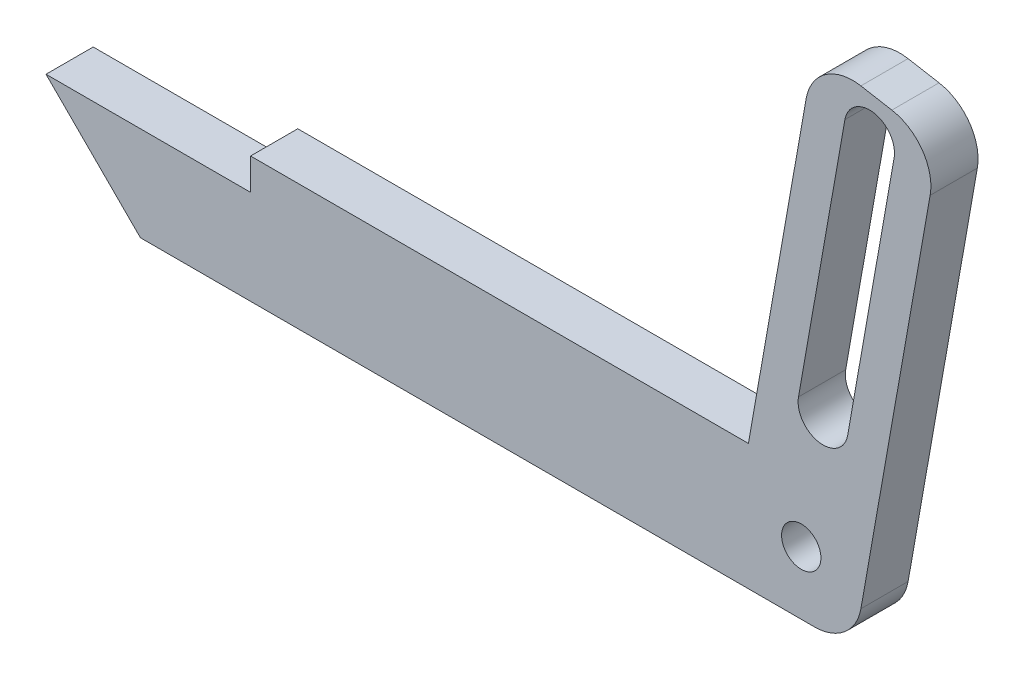
ISO-10303-21;
HEADER;
FILE_DESCRIPTION(('STEP AP214'),'2;1');
FILE_NAME('part.step','',(''),(''),'','','');
FILE_SCHEMA(('AUTOMOTIVE_DESIGN { 1 0 10303 214 1 1 1 1 }'));
ENDSEC;
DATA;
#1=APPLICATION_CONTEXT('core data for automotive mechanical design processes');
#2=APPLICATION_PROTOCOL_DEFINITION('international standard','automotive_design',2000,#1);
#3=PRODUCT_CONTEXT('',#1,'mechanical');
#4=PRODUCT('Part','Part','',(#3));
#5=PRODUCT_RELATED_PRODUCT_CATEGORY('part','',(#4));
#6=PRODUCT_DEFINITION_FORMATION('','',#4);
#7=PRODUCT_DEFINITION_CONTEXT('part definition',#1,'design');
#8=PRODUCT_DEFINITION('design','',#6,#7);
#9=PRODUCT_DEFINITION_SHAPE('','',#8);
#10=(LENGTH_UNIT() NAMED_UNIT(*) SI_UNIT(.MILLI.,.METRE.));
#11=(NAMED_UNIT(*) PLANE_ANGLE_UNIT() SI_UNIT($,.RADIAN.));
#12=(NAMED_UNIT(*) SI_UNIT($,.STERADIAN.) SOLID_ANGLE_UNIT());
#13=UNCERTAINTY_MEASURE_WITH_UNIT(LENGTH_MEASURE(1.E-05),#10,'distance_accuracy_value','');
#14=(GEOMETRIC_REPRESENTATION_CONTEXT(3) GLOBAL_UNCERTAINTY_ASSIGNED_CONTEXT((#13)) GLOBAL_UNIT_ASSIGNED_CONTEXT((#10,
#11,#12)) REPRESENTATION_CONTEXT('',''));
#15=CARTESIAN_POINT('',(0.,0.,0.));
#16=DIRECTION('',(0.,0.,1.));
#17=DIRECTION('',(1.,0.,0.));
#18=AXIS2_PLACEMENT_3D('',#15,#16,#17);
#19=CARTESIAN_POINT('',(-56.0247504159734,-23.4823211314476,3.));
#20=DIRECTION('',(0.707106781186545,0.70710678118655,0.));
#21=DIRECTION('',(-0.70710678118655,0.707106781186545,0.));
#22=AXIS2_PLACEMENT_3D('',#19,#20,#21);
#23=PLANE('',#22);
#24=DIRECTION('',(0.70710678118655,-0.707106781186545,0.));
#25=VECTOR('',#24,1.);
#26=CARTESIAN_POINT('',(-56.0247504159734,-23.4823211314476,3.));
#27=LINE('',#26,#25);
#28=CARTESIAN_POINT('',(-54.0247504159733,-25.4823211314476,3.));
#29=VERTEX_POINT('',#28);
#30=CARTESIAN_POINT('',(-48.0247504159733,-31.4823211314476,3.));
#31=VERTEX_POINT('',#30);
#32=EDGE_CURVE('E209',#29,#31,#27,.T.);
#33=ORIENTED_EDGE('',*,*,#32,.F.);
#34=DIRECTION('',(0.,0.,1.));
#35=VECTOR('',#34,1.);
#36=CARTESIAN_POINT('',(-54.0247504159733,-25.4823211314476,0.));
#37=LINE('',#36,#35);
#38=CARTESIAN_POINT('',(-54.0247504159733,-25.4823211314476,0.));
#39=VERTEX_POINT('',#38);
#40=EDGE_CURVE('E198',#39,#29,#37,.T.);
#41=ORIENTED_EDGE('',*,*,#40,.F.);
#42=DIRECTION('',(0.70710678118655,-0.707106781186545,0.));
#43=VECTOR('',#42,1.);
#44=CARTESIAN_POINT('',(-56.0247504159734,-23.4823211314476,0.));
#45=LINE('',#44,#43);
#46=CARTESIAN_POINT('',(-48.0247504159733,-31.4823211314476,0.));
#47=VERTEX_POINT('',#46);
#48=EDGE_CURVE('E205',#39,#47,#45,.T.);
#49=ORIENTED_EDGE('',*,*,#48,.T.);
#50=DIRECTION('',(0.,0.,-1.));
#51=VECTOR('',#50,1.);
#52=CARTESIAN_POINT('',(-48.0247504159733,-31.4823211314476,3.));
#53=LINE('',#52,#51);
#54=EDGE_CURVE('E241',#31,#47,#53,.T.);
#55=ORIENTED_EDGE('',*,*,#54,.F.);
#56=EDGE_LOOP('',(#33,#41,#49,#55));
#57=FACE_BOUND('',#56,.T.);
#58=ADVANCED_FACE('F36',(#57),#23,.F.);
#59=CARTESIAN_POINT('',(-2.67195336655509,-31.4823211314476,3.));
#60=DIRECTION('',(0.,1.,0.));
#61=DIRECTION('',(-1.,0.,0.));
#62=AXIS2_PLACEMENT_3D('',#59,#60,#61);
#63=PLANE('',#62);
#64=DIRECTION('',(1.,0.,0.));
#65=VECTOR('',#64,1.);
#66=CARTESIAN_POINT('',(-2.67195336655509,-31.4823211314476,0.));
#67=LINE('',#66,#65);
#68=CARTESIAN_POINT('',(-5.18925226008694,-31.4823211314476,0.));
#69=VERTEX_POINT('',#68);
#70=EDGE_CURVE('E227',#47,#69,#67,.T.);
#71=ORIENTED_EDGE('',*,*,#70,.T.);
#72=DIRECTION('',(0.,0.,-1.));
#73=VECTOR('',#72,1.);
#74=CARTESIAN_POINT('',(-5.18925226008694,-31.4823211314476,3.));
#75=LINE('',#74,#73);
#76=CARTESIAN_POINT('',(-5.18925226008694,-31.4823211314476,3.));
#77=VERTEX_POINT('',#76);
#78=EDGE_CURVE('E255',#69,#77,#75,.F.);
#79=ORIENTED_EDGE('',*,*,#78,.T.);
#80=DIRECTION('',(1.,0.,0.));
#81=VECTOR('',#80,1.);
#82=CARTESIAN_POINT('',(-2.67195336655509,-31.4823211314476,3.));
#83=LINE('',#82,#81);
#84=EDGE_CURVE('E211',#31,#77,#83,.T.);
#85=ORIENTED_EDGE('',*,*,#84,.F.);
#86=ORIENTED_EDGE('',*,*,#54,.T.);
#87=EDGE_LOOP('',(#71,#79,#85,#86));
#88=FACE_BOUND('',#87,.T.);
#89=ADVANCED_FACE('F299',(#88),#63,.F.);
#90=CARTESIAN_POINT('',(2.68557861700396,-1.09824739506822,3.));
#91=DIRECTION('',(-0.984807753012209,0.173648177666927,0.));
#92=DIRECTION('',(-0.173648177666927,-0.984807753012209,0.));
#93=AXIS2_PLACEMENT_3D('',#90,#91,#92);
#94=PLANE('',#93);
#95=DIRECTION('',(0.173648177666927,0.984807753012208,0.));
#96=VECTOR('',#95,1.);
#97=CARTESIAN_POINT('',(2.68557861700396,-1.09824739506822,3.));
#98=LINE('',#97,#96);
#99=CARTESIAN_POINT('',(-2.23482900105031,-29.0032656644484,3.));
#100=VERTEX_POINT('',#99);
#101=CARTESIAN_POINT('',(2.16463408400317,-4.05267065410488,3.));
#102=VERTEX_POINT('',#101);
#103=EDGE_CURVE('E215',#100,#102,#98,.T.);
#104=ORIENTED_EDGE('',*,*,#103,.F.);
#105=DIRECTION('',(0.,0.,-1.));
#106=VECTOR('',#105,1.);
#107=CARTESIAN_POINT('',(-2.23482900105031,-29.0032656644484,3.));
#108=LINE('',#107,#106);
#109=CARTESIAN_POINT('',(-2.23482900105031,-29.0032656644484,0.));
#110=VERTEX_POINT('',#109);
#111=EDGE_CURVE('E246',#100,#110,#108,.T.);
#112=ORIENTED_EDGE('',*,*,#111,.T.);
#113=DIRECTION('',(0.173648177666927,0.984807753012208,0.));
#114=VECTOR('',#113,1.);
#115=CARTESIAN_POINT('',(2.68557861700396,-1.09824739506822,0.));
#116=LINE('',#115,#114);
#117=CARTESIAN_POINT('',(2.16463408400317,-4.05267065410488,0.));
#118=VERTEX_POINT('',#117);
#119=EDGE_CURVE('E230',#110,#118,#116,.T.);
#120=ORIENTED_EDGE('',*,*,#119,.T.);
#121=DIRECTION('',(0.,0.,-1.));
#122=VECTOR('',#121,1.);
#123=CARTESIAN_POINT('',(2.16463408400317,-4.05267065410488,3.));
#124=LINE('',#123,#122);
#125=EDGE_CURVE('E244',#118,#102,#124,.F.);
#126=ORIENTED_EDGE('',*,*,#125,.T.);
#127=EDGE_LOOP('',(#104,#112,#120,#126));
#128=FACE_BOUND('',#127,.T.);
#129=ADVANCED_FACE('F306',(#128),#94,.F.);
#130=CARTESIAN_POINT('',(-5.19288340709372,0.290938026267115,3.));
#131=DIRECTION('',(-0.173648177666917,-0.98480775301221,0.));
#132=DIRECTION('',(0.98480775301221,-0.173648177666917,0.));
#133=AXIS2_PLACEMENT_3D('',#130,#131,#132);
#134=PLANE('',#133);
#135=DIRECTION('',(-0.98480775301221,0.173648177666917,0.));
#136=VECTOR('',#135,1.);
#137=CARTESIAN_POINT('',(-5.19288340709372,0.290938026267115,0.));
#138=LINE('',#137,#136);
#139=CARTESIAN_POINT('',(-0.2688446420327,-0.577302862067467,0.));
#140=VERTEX_POINT('',#139);
#141=CARTESIAN_POINT('',(-2.23846014805712,-0.230006506733632,0.));
#142=VERTEX_POINT('',#141);
#143=EDGE_CURVE('E233',#140,#142,#138,.T.);
#144=ORIENTED_EDGE('',*,*,#143,.T.);
#145=DIRECTION('',(0.,0.,-1.));
#146=VECTOR('',#145,1.);
#147=CARTESIAN_POINT('',(-2.23846014805712,-0.230006506733632,3.));
#148=LINE('',#147,#146);
#149=CARTESIAN_POINT('',(-2.23846014805712,-0.230006506733632,3.));
#150=VERTEX_POINT('',#149);
#151=EDGE_CURVE('E11',#142,#150,#148,.F.);
#152=ORIENTED_EDGE('',*,*,#151,.T.);
#153=DIRECTION('',(-0.98480775301221,0.173648177666917,0.));
#154=VECTOR('',#153,1.);
#155=CARTESIAN_POINT('',(-5.19288340709372,0.290938026267115,3.));
#156=LINE('',#155,#154);
#157=CARTESIAN_POINT('',(-0.2688446420327,-0.577302862067467,3.));
#158=VERTEX_POINT('',#157);
#159=EDGE_CURVE('E218',#158,#150,#156,.T.);
#160=ORIENTED_EDGE('',*,*,#159,.F.);
#161=DIRECTION('',(0.,0.,-1.));
#162=VECTOR('',#161,1.);
#163=CARTESIAN_POINT('',(-0.268844642032699,-0.577302862067467,3.));
#164=LINE('',#163,#162);
#165=EDGE_CURVE('E44',#158,#140,#164,.T.);
#166=ORIENTED_EDGE('',*,*,#165,.T.);
#167=EDGE_LOOP('',(#144,#152,#160,#166));
#168=FACE_BOUND('',#167,.T.);
#169=ADVANCED_FACE('F267',(#168),#134,.F.);
#170=CARTESIAN_POINT('',(-9.38475041597335,-23.4823211314476,3.));
#171=DIRECTION('',(0.984807753012209,-0.173648177666927,0.));
#172=DIRECTION('',(0.173648177666927,0.984807753012209,0.));
#173=AXIS2_PLACEMENT_3D('',#170,#171,#172);
#174=PLANE('',#173);
#175=DIRECTION('',(-0.173648177666927,-0.984807753012209,0.));
#176=VECTOR('',#175,1.);
#177=CARTESIAN_POINT('',(-9.38475041597335,-23.4823211314476,3.));
#178=LINE('',#177,#176);
#179=CARTESIAN_POINT('',(-5.7138279400945,-2.66348523276948,3.));
#180=VERTEX_POINT('',#179);
#181=CARTESIAN_POINT('',(-9.38475041597335,-23.4823211314476,3.));
#182=VERTEX_POINT('',#181);
#183=EDGE_CURVE('E220',#180,#182,#178,.T.);
#184=ORIENTED_EDGE('',*,*,#183,.F.);
#185=DIRECTION('',(0.,0.,-1.));
#186=VECTOR('',#185,1.);
#187=CARTESIAN_POINT('',(-5.7138279400945,-2.66348523276948,3.));
#188=LINE('',#187,#186);
#189=CARTESIAN_POINT('',(-5.7138279400945,-2.66348523276948,0.));
#190=VERTEX_POINT('',#189);
#191=EDGE_CURVE('E262',#180,#190,#188,.T.);
#192=ORIENTED_EDGE('',*,*,#191,.T.);
#193=DIRECTION('',(-0.173648177666927,-0.984807753012209,0.));
#194=VECTOR('',#193,1.);
#195=CARTESIAN_POINT('',(-9.38475041597335,-23.4823211314476,0.));
#196=LINE('',#195,#194);
#197=CARTESIAN_POINT('',(-9.38475041597335,-23.4823211314476,0.));
#198=VERTEX_POINT('',#197);
#199=EDGE_CURVE('E235',#190,#198,#196,.T.);
#200=ORIENTED_EDGE('',*,*,#199,.T.);
#201=DIRECTION('',(0.,0.,-1.));
#202=VECTOR('',#201,1.);
#203=CARTESIAN_POINT('',(-9.38475041597335,-23.4823211314476,3.));
#204=LINE('',#203,#202);
#205=EDGE_CURVE('E225',#182,#198,#204,.T.);
#206=ORIENTED_EDGE('',*,*,#205,.F.);
#207=EDGE_LOOP('',(#184,#192,#200,#206));
#208=FACE_BOUND('',#207,.T.);
#209=ADVANCED_FACE('F277',(#208),#174,.F.);
#210=CARTESIAN_POINT('',(-56.0247504159734,-23.4823211314476,3.));
#211=DIRECTION('',(0.,-1.,0.));
#212=DIRECTION('',(0.,0.,-1.));
#213=AXIS2_PLACEMENT_3D('',#210,#211,#212);
#214=PLANE('',#213);
#215=DIRECTION('',(-1.,0.,0.));
#216=VECTOR('',#215,1.);
#217=CARTESIAN_POINT('',(-56.0247504159734,-23.4823211314476,0.));
#218=LINE('',#217,#216);
#219=CARTESIAN_POINT('',(-41.0247504159734,-23.4823211314476,0.));
#220=VERTEX_POINT('',#219);
#221=EDGE_CURVE('E212',#198,#220,#218,.T.);
#222=ORIENTED_EDGE('',*,*,#221,.T.);
#223=DIRECTION('',(0.,0.,1.));
#224=VECTOR('',#223,1.);
#225=CARTESIAN_POINT('',(-41.0247504159734,-23.4823211314476,0.));
#226=LINE('',#225,#224);
#227=CARTESIAN_POINT('',(-41.0247504159734,-23.4823211314476,3.));
#228=VERTEX_POINT('',#227);
#229=EDGE_CURVE('E202',#220,#228,#226,.T.);
#230=ORIENTED_EDGE('',*,*,#229,.T.);
#231=DIRECTION('',(-1.,0.,0.));
#232=VECTOR('',#231,1.);
#233=CARTESIAN_POINT('',(-56.0247504159734,-23.4823211314476,3.));
#234=LINE('',#233,#232);
#235=EDGE_CURVE('E222',#182,#228,#234,.T.);
#236=ORIENTED_EDGE('',*,*,#235,.F.);
#237=ORIENTED_EDGE('',*,*,#205,.T.);
#238=EDGE_LOOP('',(#222,#230,#236,#237));
#239=FACE_BOUND('',#238,.T.);
#240=ADVANCED_FACE('F284',(#239),#214,.F.);
#241=CARTESIAN_POINT('',(0.,0.,3.));
#242=DIRECTION('',(0.,0.,-1.));
#243=DIRECTION('',(-1.,0.,0.));
#244=AXIS2_PLACEMENT_3D('',#241,#242,#243);
#245=PLANE('',#244);
#246=CARTESIAN_POINT('',(-6.02835189126393,-27.4823211314476,3.));
#247=DIRECTION('',(0.,0.,1.));
#248=DIRECTION('',(1.,0.,0.));
#249=AXIS2_PLACEMENT_3D('',#246,#247,#248);
#250=CIRCLE('',#249,1.25);
#251=CARTESIAN_POINT('',(-4.77835189126393,-27.4823211314476,3.));
#252=VERTEX_POINT('',#251);
#253=EDGE_CURVE('E174',#252,#252,#250,.T.);
#254=ORIENTED_EDGE('',*,*,#253,.F.);
#255=EDGE_LOOP('',(#254));
#256=FACE_BOUND('',#255,.T.);
#257=DIRECTION('',(-0.173648177666927,-0.984807753012209,0.));
#258=VECTOR('',#257,1.);
#259=CARTESIAN_POINT('',(-3.25115514711906,-2.59000758488485,3.));
#260=LINE('',#259,#258);
#261=CARTESIAN_POINT('',(-3.25115514711906,-2.59000758488485,3.));
#262=VERTEX_POINT('',#261);
#263=CARTESIAN_POINT('',(-6.20317416745682,-19.3317393860924,3.));
#264=VERTEX_POINT('',#263);
#265=EDGE_CURVE('E180',#262,#264,#260,.T.);
#266=ORIENTED_EDGE('',*,*,#265,.F.);
#267=CARTESIAN_POINT('',(-1.68777283921217,-2.86567406693108,3.));
#268=DIRECTION('',(0.,0.,1.));
#269=DIRECTION('',(1.,0.,0.));
#270=AXIS2_PLACEMENT_3D('',#267,#268,#269);
#271=CIRCLE('',#270,1.5875);
#272=CARTESIAN_POINT('',(-0.12439053130529,-3.14134054897731,3.));
#273=VERTEX_POINT('',#272);
#274=EDGE_CURVE('E150',#273,#262,#271,.T.);
#275=ORIENTED_EDGE('',*,*,#274,.F.);
#276=DIRECTION('',(0.173648177666927,0.984807753012209,0.));
#277=VECTOR('',#276,1.);
#278=CARTESIAN_POINT('',(-0.12439053130529,-3.14134054897731,3.));
#279=LINE('',#278,#277);
#280=CARTESIAN_POINT('',(-3.07640955164306,-19.8830723501849,3.));
#281=VERTEX_POINT('',#280);
#282=EDGE_CURVE('E168',#281,#273,#279,.T.);
#283=ORIENTED_EDGE('',*,*,#282,.F.);
#284=CARTESIAN_POINT('',(-4.63979185954994,-19.6074058681386,3.));
#285=DIRECTION('',(0.,0.,1.));
#286=DIRECTION('',(1.,0.,0.));
#287=AXIS2_PLACEMENT_3D('',#284,#285,#286);
#288=CIRCLE('',#287,1.5875);
#289=EDGE_CURVE('E171',#264,#281,#288,.T.);
#290=ORIENTED_EDGE('',*,*,#289,.F.);
#291=EDGE_LOOP('',(#266,#275,#283,#290));
#292=FACE_BOUND('',#291,.T.);
#293=ORIENTED_EDGE('',*,*,#84,.T.);
#294=CARTESIAN_POINT('',(-5.18925226008694,-28.4823211314476,3.));
#295=DIRECTION('',(0.,0.,-1.));
#296=DIRECTION('',(-1.,0.,0.));
#297=AXIS2_PLACEMENT_3D('',#294,#295,#296);
#298=CIRCLE('',#297,3.);
#299=EDGE_CURVE('E260',#77,#100,#298,.F.);
#300=ORIENTED_EDGE('',*,*,#299,.T.);
#301=ORIENTED_EDGE('',*,*,#103,.T.);
#302=CARTESIAN_POINT('',(-0.789789175033451,-3.5317261211041,3.));
#303=DIRECTION('',(0.,0.,-1.));
#304=DIRECTION('',(-1.,0.,0.));
#305=AXIS2_PLACEMENT_3D('',#302,#303,#304);
#306=CIRCLE('',#305,3.);
#307=EDGE_CURVE('E257',#102,#158,#306,.F.);
#308=ORIENTED_EDGE('',*,*,#307,.T.);
#309=ORIENTED_EDGE('',*,*,#159,.T.);
#310=CARTESIAN_POINT('',(-2.75940468105787,-3.18442976577026,3.));
#311=DIRECTION('',(0.,0.,-1.));
#312=DIRECTION('',(-1.,0.,0.));
#313=AXIS2_PLACEMENT_3D('',#310,#311,#312);
#314=CIRCLE('',#313,3.);
#315=EDGE_CURVE('E51',#150,#180,#314,.F.);
#316=ORIENTED_EDGE('',*,*,#315,.T.);
#317=ORIENTED_EDGE('',*,*,#183,.T.);
#318=ORIENTED_EDGE('',*,*,#235,.T.);
#319=DIRECTION('',(0.,1.,0.));
#320=VECTOR('',#319,1.);
#321=CARTESIAN_POINT('',(-41.0247504159734,-23.4823211314476,3.));
#322=LINE('',#321,#320);
#323=CARTESIAN_POINT('',(-41.0247504159733,-25.4823211314476,3.));
#324=VERTEX_POINT('',#323);
#325=EDGE_CURVE('E195',#324,#228,#322,.T.);
#326=ORIENTED_EDGE('',*,*,#325,.F.);
#327=DIRECTION('',(1.,0.,0.));
#328=VECTOR('',#327,1.);
#329=CARTESIAN_POINT('',(-41.0247504159733,-25.4823211314476,3.));
#330=LINE('',#329,#328);
#331=EDGE_CURVE('E187',#29,#324,#330,.T.);
#332=ORIENTED_EDGE('',*,*,#331,.F.);
#333=ORIENTED_EDGE('',*,*,#32,.T.);
#334=EDGE_LOOP('',(#293,#300,#301,#308,#309,#316,#317,#318,#326,#332,#333));
#335=FACE_BOUND('',#334,.T.);
#336=ADVANCED_FACE('F280',(#256,#292,#335),#245,.F.);
#337=CARTESIAN_POINT('',(0.,0.,0.));
#338=DIRECTION('',(0.,0.,-1.));
#339=DIRECTION('',(-1.,0.,0.));
#340=AXIS2_PLACEMENT_3D('',#337,#338,#339);
#341=PLANE('',#340);
#342=CARTESIAN_POINT('',(-6.02835189126393,-27.4823211314476,0.));
#343=DIRECTION('',(0.,0.,1.));
#344=DIRECTION('',(1.,0.,0.));
#345=AXIS2_PLACEMENT_3D('',#342,#343,#344);
#346=CIRCLE('',#345,1.25);
#347=CARTESIAN_POINT('',(-4.77835189126393,-27.4823211314476,0.));
#348=VERTEX_POINT('',#347);
#349=EDGE_CURVE('E181',#348,#348,#346,.T.);
#350=ORIENTED_EDGE('',*,*,#349,.T.);
#351=EDGE_LOOP('',(#350));
#352=FACE_BOUND('',#351,.T.);
#353=CARTESIAN_POINT('',(-1.68777283921217,-2.86567406693108,0.));
#354=DIRECTION('',(0.,0.,1.));
#355=DIRECTION('',(1.,0.,0.));
#356=AXIS2_PLACEMENT_3D('',#353,#354,#355);
#357=CIRCLE('',#356,1.5875);
#358=CARTESIAN_POINT('',(-0.12439053130529,-3.14134054897731,0.));
#359=VERTEX_POINT('',#358);
#360=CARTESIAN_POINT('',(-3.25115514711906,-2.59000758488485,0.));
#361=VERTEX_POINT('',#360);
#362=EDGE_CURVE('E147',#359,#361,#357,.T.);
#363=ORIENTED_EDGE('',*,*,#362,.T.);
#364=DIRECTION('',(-0.173648177666927,-0.984807753012209,0.));
#365=VECTOR('',#364,1.);
#366=CARTESIAN_POINT('',(-3.25115514711906,-2.59000758488485,0.));
#367=LINE('',#366,#365);
#368=CARTESIAN_POINT('',(-6.20317416745682,-19.3317393860924,0.));
#369=VERTEX_POINT('',#368);
#370=EDGE_CURVE('E159',#361,#369,#367,.T.);
#371=ORIENTED_EDGE('',*,*,#370,.T.);
#372=CARTESIAN_POINT('',(-4.63979185954994,-19.6074058681386,0.));
#373=DIRECTION('',(0.,0.,1.));
#374=DIRECTION('',(1.,0.,0.));
#375=AXIS2_PLACEMENT_3D('',#372,#373,#374);
#376=CIRCLE('',#375,1.5875);
#377=CARTESIAN_POINT('',(-3.07640955164306,-19.8830723501849,0.));
#378=VERTEX_POINT('',#377);
#379=EDGE_CURVE('E163',#369,#378,#376,.T.);
#380=ORIENTED_EDGE('',*,*,#379,.T.);
#381=DIRECTION('',(0.173648177666927,0.984807753012209,0.));
#382=VECTOR('',#381,1.);
#383=CARTESIAN_POINT('',(-0.12439053130529,-3.14134054897731,0.));
#384=LINE('',#383,#382);
#385=EDGE_CURVE('E155',#378,#359,#384,.T.);
#386=ORIENTED_EDGE('',*,*,#385,.T.);
#387=EDGE_LOOP('',(#363,#371,#380,#386));
#388=FACE_BOUND('',#387,.T.);
#389=ORIENTED_EDGE('',*,*,#119,.F.);
#390=CARTESIAN_POINT('',(-5.18925226008694,-28.4823211314476,0.));
#391=DIRECTION('',(0.,0.,-1.));
#392=DIRECTION('',(-1.,0.,0.));
#393=AXIS2_PLACEMENT_3D('',#390,#391,#392);
#394=CIRCLE('',#393,3.);
#395=EDGE_CURVE('E253',#110,#69,#394,.T.);
#396=ORIENTED_EDGE('',*,*,#395,.T.);
#397=ORIENTED_EDGE('',*,*,#70,.F.);
#398=ORIENTED_EDGE('',*,*,#48,.F.);
#399=DIRECTION('',(1.,0.,0.));
#400=VECTOR('',#399,1.);
#401=CARTESIAN_POINT('',(-41.0247504159733,-25.4823211314476,0.));
#402=LINE('',#401,#400);
#403=CARTESIAN_POINT('',(-41.0247504159733,-25.4823211314476,0.));
#404=VERTEX_POINT('',#403);
#405=EDGE_CURVE('E191',#39,#404,#402,.T.);
#406=ORIENTED_EDGE('',*,*,#405,.T.);
#407=DIRECTION('',(0.,1.,0.));
#408=VECTOR('',#407,1.);
#409=CARTESIAN_POINT('',(-41.0247504159734,-23.4823211314476,0.));
#410=LINE('',#409,#408);
#411=EDGE_CURVE('E194',#404,#220,#410,.T.);
#412=ORIENTED_EDGE('',*,*,#411,.T.);
#413=ORIENTED_EDGE('',*,*,#221,.F.);
#414=ORIENTED_EDGE('',*,*,#199,.F.);
#415=CARTESIAN_POINT('',(-2.75940468105787,-3.18442976577026,0.));
#416=DIRECTION('',(0.,0.,-1.));
#417=DIRECTION('',(-1.,0.,0.));
#418=AXIS2_PLACEMENT_3D('',#415,#416,#417);
#419=CIRCLE('',#418,3.);
#420=EDGE_CURVE('E251',#190,#142,#419,.T.);
#421=ORIENTED_EDGE('',*,*,#420,.T.);
#422=ORIENTED_EDGE('',*,*,#143,.F.);
#423=CARTESIAN_POINT('',(-0.789789175033451,-3.5317261211041,0.));
#424=DIRECTION('',(0.,0.,-1.));
#425=DIRECTION('',(-1.,0.,0.));
#426=AXIS2_PLACEMENT_3D('',#423,#424,#425);
#427=CIRCLE('',#426,3.);
#428=EDGE_CURVE('E249',#140,#118,#427,.T.);
#429=ORIENTED_EDGE('',*,*,#428,.T.);
#430=EDGE_LOOP('',(#389,#396,#397,#398,#406,#412,#413,#414,#421,#422,#429));
#431=FACE_BOUND('',#430,.T.);
#432=ADVANCED_FACE('F165',(#352,#388,#431),#341,.T.);
#433=CARTESIAN_POINT('',(-41.0247504159734,-23.4823211314476,0.));
#434=DIRECTION('',(1.,0.,0.));
#435=DIRECTION('',(0.,1.,0.));
#436=AXIS2_PLACEMENT_3D('',#433,#434,#435);
#437=PLANE('',#436);
#438=ORIENTED_EDGE('',*,*,#325,.T.);
#439=ORIENTED_EDGE('',*,*,#229,.F.);
#440=ORIENTED_EDGE('',*,*,#411,.F.);
#441=DIRECTION('',(0.,0.,1.));
#442=VECTOR('',#441,1.);
#443=CARTESIAN_POINT('',(-41.0247504159733,-25.4823211314476,0.));
#444=LINE('',#443,#442);
#445=EDGE_CURVE('E206',#404,#324,#444,.T.);
#446=ORIENTED_EDGE('',*,*,#445,.T.);
#447=EDGE_LOOP('',(#438,#439,#440,#446));
#448=FACE_BOUND('',#447,.T.);
#449=ADVANCED_FACE('F286',(#448),#437,.F.);
#450=CARTESIAN_POINT('',(-41.0247504159733,-25.4823211314476,0.));
#451=DIRECTION('',(0.,-1.,0.));
#452=DIRECTION('',(0.,0.,-1.));
#453=AXIS2_PLACEMENT_3D('',#450,#451,#452);
#454=PLANE('',#453);
#455=ORIENTED_EDGE('',*,*,#331,.T.);
#456=ORIENTED_EDGE('',*,*,#445,.F.);
#457=ORIENTED_EDGE('',*,*,#405,.F.);
#458=ORIENTED_EDGE('',*,*,#40,.T.);
#459=EDGE_LOOP('',(#455,#456,#457,#458));
#460=FACE_BOUND('',#459,.T.);
#461=ADVANCED_FACE('F292',(#460),#454,.F.);
#462=CARTESIAN_POINT('',(-1.68777283921217,-2.86567406693108,0.));
#463=DIRECTION('',(0.,0.,1.));
#464=DIRECTION('',(1.,0.,0.));
#465=AXIS2_PLACEMENT_3D('',#462,#463,#464);
#466=CYLINDRICAL_SURFACE('',#465,1.5875);
#467=ORIENTED_EDGE('',*,*,#274,.T.);
#468=DIRECTION('',(0.,0.,1.));
#469=VECTOR('',#468,1.);
#470=CARTESIAN_POINT('',(-3.25115514711906,-2.59000758488485,0.));
#471=LINE('',#470,#469);
#472=EDGE_CURVE('E143',#361,#262,#471,.T.);
#473=ORIENTED_EDGE('',*,*,#472,.F.);
#474=ORIENTED_EDGE('',*,*,#362,.F.);
#475=DIRECTION('',(0.,0.,1.));
#476=VECTOR('',#475,1.);
#477=CARTESIAN_POINT('',(-0.12439053130529,-3.14134054897731,0.));
#478=LINE('',#477,#476);
#479=EDGE_CURVE('E185',#359,#273,#478,.T.);
#480=ORIENTED_EDGE('',*,*,#479,.T.);
#481=EDGE_LOOP('',(#467,#473,#474,#480));
#482=FACE_BOUND('',#481,.T.);
#483=ADVANCED_FACE('F145',(#482),#466,.F.);
#484=CARTESIAN_POINT('',(-0.12439053130529,-3.14134054897731,0.));
#485=DIRECTION('',(0.984807753012209,-0.173648177666927,0.));
#486=DIRECTION('',(0.173648177666927,0.984807753012209,0.));
#487=AXIS2_PLACEMENT_3D('',#484,#485,#486);
#488=PLANE('',#487);
#489=ORIENTED_EDGE('',*,*,#282,.T.);
#490=ORIENTED_EDGE('',*,*,#479,.F.);
#491=ORIENTED_EDGE('',*,*,#385,.F.);
#492=DIRECTION('',(0.,0.,1.));
#493=VECTOR('',#492,1.);
#494=CARTESIAN_POINT('',(-3.07640955164306,-19.8830723501849,0.));
#495=LINE('',#494,#493);
#496=EDGE_CURVE('E188',#378,#281,#495,.T.);
#497=ORIENTED_EDGE('',*,*,#496,.T.);
#498=EDGE_LOOP('',(#489,#490,#491,#497));
#499=FACE_BOUND('',#498,.T.);
#500=ADVANCED_FACE('F335',(#499),#488,.F.);
#501=CARTESIAN_POINT('',(-4.63979185954994,-19.6074058681386,0.));
#502=DIRECTION('',(0.,0.,1.));
#503=DIRECTION('',(1.,0.,0.));
#504=AXIS2_PLACEMENT_3D('',#501,#502,#503);
#505=CYLINDRICAL_SURFACE('',#504,1.5875);
#506=ORIENTED_EDGE('',*,*,#289,.T.);
#507=ORIENTED_EDGE('',*,*,#496,.F.);
#508=ORIENTED_EDGE('',*,*,#379,.F.);
#509=DIRECTION('',(0.,0.,1.));
#510=VECTOR('',#509,1.);
#511=CARTESIAN_POINT('',(-6.20317416745682,-19.3317393860924,0.));
#512=LINE('',#511,#510);
#513=EDGE_CURVE('E154',#369,#264,#512,.T.);
#514=ORIENTED_EDGE('',*,*,#513,.T.);
#515=EDGE_LOOP('',(#506,#507,#508,#514));
#516=FACE_BOUND('',#515,.T.);
#517=ADVANCED_FACE('F330',(#516),#505,.F.);
#518=CARTESIAN_POINT('',(-3.25115514711906,-2.59000758488485,0.));
#519=DIRECTION('',(-0.984807753012209,0.173648177666927,0.));
#520=DIRECTION('',(-0.173648177666927,-0.984807753012209,0.));
#521=AXIS2_PLACEMENT_3D('',#518,#519,#520);
#522=PLANE('',#521);
#523=ORIENTED_EDGE('',*,*,#265,.T.);
#524=ORIENTED_EDGE('',*,*,#513,.F.);
#525=ORIENTED_EDGE('',*,*,#370,.F.);
#526=ORIENTED_EDGE('',*,*,#472,.T.);
#527=EDGE_LOOP('',(#523,#524,#525,#526));
#528=FACE_BOUND('',#527,.T.);
#529=ADVANCED_FACE('F160',(#528),#522,.F.);
#530=CARTESIAN_POINT('',(-6.02835189126393,-27.4823211314476,0.));
#531=DIRECTION('',(0.,0.,1.));
#532=DIRECTION('',(1.,0.,0.));
#533=AXIS2_PLACEMENT_3D('',#530,#531,#532);
#534=CYLINDRICAL_SURFACE('',#533,1.25);
#535=ORIENTED_EDGE('',*,*,#349,.F.);
#536=EDGE_LOOP('',(#535));
#537=FACE_BOUND('',#536,.T.);
#538=ORIENTED_EDGE('',*,*,#253,.T.);
#539=EDGE_LOOP('',(#538));
#540=FACE_BOUND('',#539,.T.);
#541=ADVANCED_FACE('F321',(#537,#540),#534,.F.);
#542=CARTESIAN_POINT('',(-5.18925226008694,-28.4823211314476,3.));
#543=DIRECTION('',(0.,0.,-1.));
#544=DIRECTION('',(-1.,0.,0.));
#545=AXIS2_PLACEMENT_3D('',#542,#543,#544);
#546=CYLINDRICAL_SURFACE('',#545,3.);
#547=ORIENTED_EDGE('',*,*,#299,.F.);
#548=ORIENTED_EDGE('',*,*,#78,.F.);
#549=ORIENTED_EDGE('',*,*,#395,.F.);
#550=ORIENTED_EDGE('',*,*,#111,.F.);
#551=EDGE_LOOP('',(#547,#548,#549,#550));
#552=FACE_BOUND('',#551,.T.);
#553=ADVANCED_FACE('F302',(#552),#546,.T.);
#554=CARTESIAN_POINT('',(-2.75940468105787,-3.18442976577026,3.));
#555=DIRECTION('',(0.,0.,-1.));
#556=DIRECTION('',(-1.,0.,0.));
#557=AXIS2_PLACEMENT_3D('',#554,#555,#556);
#558=CYLINDRICAL_SURFACE('',#557,3.);
#559=ORIENTED_EDGE('',*,*,#315,.F.);
#560=ORIENTED_EDGE('',*,*,#151,.F.);
#561=ORIENTED_EDGE('',*,*,#420,.F.);
#562=ORIENTED_EDGE('',*,*,#191,.F.);
#563=EDGE_LOOP('',(#559,#560,#561,#562));
#564=FACE_BOUND('',#563,.T.);
#565=ADVANCED_FACE('F275',(#564),#558,.T.);
#566=CARTESIAN_POINT('',(-0.789789175033451,-3.5317261211041,3.));
#567=DIRECTION('',(0.,0.,-1.));
#568=DIRECTION('',(-1.,0.,0.));
#569=AXIS2_PLACEMENT_3D('',#566,#567,#568);
#570=CYLINDRICAL_SURFACE('',#569,3.);
#571=ORIENTED_EDGE('',*,*,#307,.F.);
#572=ORIENTED_EDGE('',*,*,#125,.F.);
#573=ORIENTED_EDGE('',*,*,#428,.F.);
#574=ORIENTED_EDGE('',*,*,#165,.F.);
#575=EDGE_LOOP('',(#571,#572,#573,#574));
#576=FACE_BOUND('',#575,.T.);
#577=ADVANCED_FACE('F38',(#576),#570,.T.);
#578=CLOSED_SHELL('',(#58,#89,#129,#169,#209,#240,#336,#432,#449,#461,#483,#500,#517,#529,#541,
#553,#565,#577));
#579=MANIFOLD_SOLID_BREP('B2',#578);
#580=ADVANCED_BREP_SHAPE_REPRESENTATION('',(#18,#579),#14);
#581=SHAPE_DEFINITION_REPRESENTATION(#9,#580);
ENDSEC;
END-ISO-10303-21;
